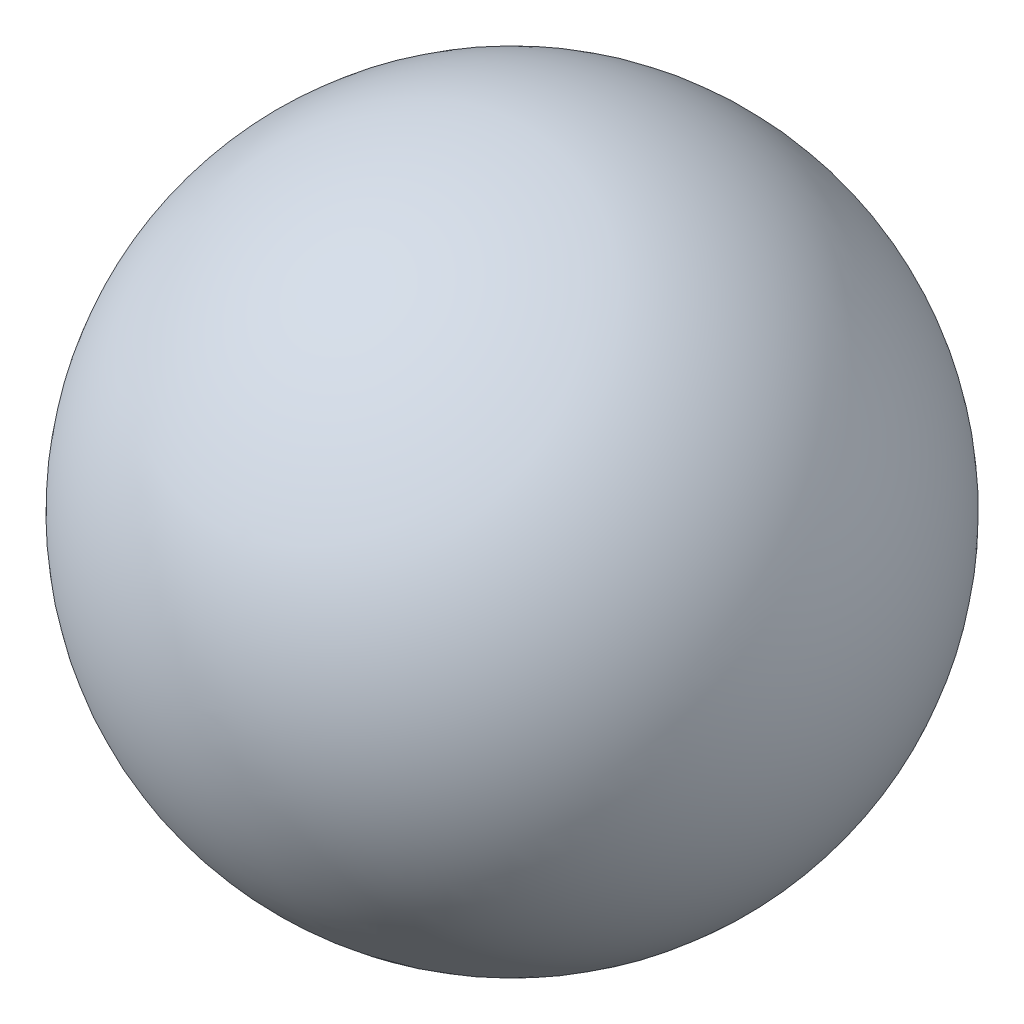
ISO-10303-21;
HEADER;
FILE_DESCRIPTION(('STEP AP214'),'2;1');
FILE_NAME('part.step','',(''),(''),'','','');
FILE_SCHEMA(('AUTOMOTIVE_DESIGN { 1 0 10303 214 1 1 1 1 }'));
ENDSEC;
DATA;
#1=APPLICATION_CONTEXT('core data for automotive mechanical design processes');
#2=APPLICATION_PROTOCOL_DEFINITION('international standard','automotive_design',2000,#1);
#3=PRODUCT_CONTEXT('',#1,'mechanical');
#4=PRODUCT('Part','Part','',(#3));
#5=PRODUCT_RELATED_PRODUCT_CATEGORY('part','',(#4));
#6=PRODUCT_DEFINITION_FORMATION('','',#4);
#7=PRODUCT_DEFINITION_CONTEXT('part definition',#1,'design');
#8=PRODUCT_DEFINITION('design','',#6,#7);
#9=PRODUCT_DEFINITION_SHAPE('','',#8);
#10=(LENGTH_UNIT() NAMED_UNIT(*) SI_UNIT(.MILLI.,.METRE.));
#11=(NAMED_UNIT(*) PLANE_ANGLE_UNIT() SI_UNIT($,.RADIAN.));
#12=(NAMED_UNIT(*) SI_UNIT($,.STERADIAN.) SOLID_ANGLE_UNIT());
#13=UNCERTAINTY_MEASURE_WITH_UNIT(LENGTH_MEASURE(1.E-05),#10,'distance_accuracy_value','');
#14=(GEOMETRIC_REPRESENTATION_CONTEXT(3) GLOBAL_UNCERTAINTY_ASSIGNED_CONTEXT((#13)) GLOBAL_UNIT_ASSIGNED_CONTEXT((#10,
#11,#12)) REPRESENTATION_CONTEXT('',''));
#15=CARTESIAN_POINT('',(0.,0.,0.));
#16=DIRECTION('',(0.,0.,1.));
#17=DIRECTION('',(1.,0.,0.));
#18=AXIS2_PLACEMENT_3D('',#15,#16,#17);
#19=CARTESIAN_POINT('',(64.16,56.3324992532819,40.5049406477677));
#20=DIRECTION('',(0.,0.811906363998111,0.583787680667707));
#21=DIRECTION('',(0.173648177666934,-0.574918634034569,0.799571681985285));
#22=AXIS2_PLACEMENT_3D('',#19,#20,#21);
#23=SPHERICAL_SURFACE('',#22,7.15);
#24=CARTESIAN_POINT('',(64.16,62.1376297558683,44.6790225645418));
#25=VERTEX_POINT('',#24);
#26=VERTEX_LOOP('',#25);
#27=FACE_BOUND('',#26,.T.);
#28=CARTESIAN_POINT('',(64.16,50.5273687506954,36.3308587309936));
#29=VERTEX_POINT('',#28);
#30=VERTEX_LOOP('',#29);
#31=FACE_BOUND('',#30,.T.);
#32=ADVANCED_FACE('F23',(#27,#31),#23,.T.);
#33=CLOSED_SHELL('',(#32));
#34=MANIFOLD_SOLID_BREP('B1',#33);
#35=ADVANCED_BREP_SHAPE_REPRESENTATION('',(#18,#34),#14);
#36=SHAPE_DEFINITION_REPRESENTATION(#9,#35);
ENDSEC;
END-ISO-10303-21;
